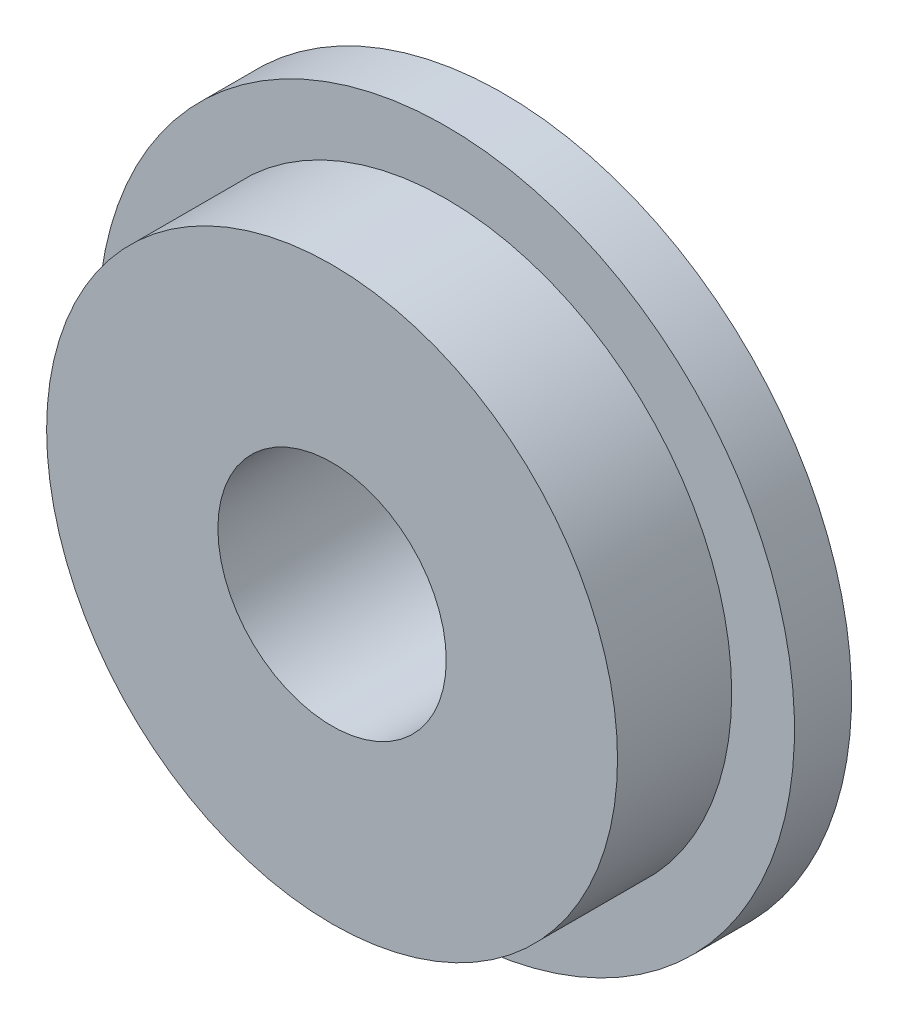
ISO-10303-21;
HEADER;
FILE_DESCRIPTION(('STEP AP214'),'2;1');
FILE_NAME('part.step','',(''),(''),'','','');
FILE_SCHEMA(('AUTOMOTIVE_DESIGN { 1 0 10303 214 1 1 1 1 }'));
ENDSEC;
DATA;
#1=APPLICATION_CONTEXT('core data for automotive mechanical design processes');
#2=APPLICATION_PROTOCOL_DEFINITION('international standard','automotive_design',2000,#1);
#3=PRODUCT_CONTEXT('',#1,'mechanical');
#4=PRODUCT('Part','Part','',(#3));
#5=PRODUCT_RELATED_PRODUCT_CATEGORY('part','',(#4));
#6=PRODUCT_DEFINITION_FORMATION('','',#4);
#7=PRODUCT_DEFINITION_CONTEXT('part definition',#1,'design');
#8=PRODUCT_DEFINITION('design','',#6,#7);
#9=PRODUCT_DEFINITION_SHAPE('','',#8);
#10=(LENGTH_UNIT() NAMED_UNIT(*) SI_UNIT(.MILLI.,.METRE.));
#11=(NAMED_UNIT(*) PLANE_ANGLE_UNIT() SI_UNIT($,.RADIAN.));
#12=(NAMED_UNIT(*) SI_UNIT($,.STERADIAN.) SOLID_ANGLE_UNIT());
#13=UNCERTAINTY_MEASURE_WITH_UNIT(LENGTH_MEASURE(1.E-05),#10,'distance_accuracy_value','');
#14=(GEOMETRIC_REPRESENTATION_CONTEXT(3) GLOBAL_UNCERTAINTY_ASSIGNED_CONTEXT((#13)) GLOBAL_UNIT_ASSIGNED_CONTEXT((#10,
#11,#12)) REPRESENTATION_CONTEXT('',''));
#15=CARTESIAN_POINT('',(0.,0.,0.));
#16=DIRECTION('',(0.,0.,1.));
#17=DIRECTION('',(1.,0.,0.));
#18=AXIS2_PLACEMENT_3D('',#15,#16,#17);
#19=CARTESIAN_POINT('',(0.,0.,1.5));
#20=DIRECTION('',(0.,0.,-1.));
#21=DIRECTION('',(-1.,0.,0.));
#22=AXIS2_PLACEMENT_3D('',#19,#20,#21);
#23=CYLINDRICAL_SURFACE('',#22,2.5);
#24=CARTESIAN_POINT('',(0.,0.,1.5));
#25=DIRECTION('',(0.,0.,1.));
#26=DIRECTION('',(1.,0.,0.));
#27=AXIS2_PLACEMENT_3D('',#24,#25,#26);
#28=CIRCLE('',#27,2.5);
#29=CARTESIAN_POINT('',(2.5,0.,1.5));
#30=VERTEX_POINT('',#29);
#31=EDGE_CURVE('E46',#30,#30,#28,.T.);
#32=ORIENTED_EDGE('',*,*,#31,.F.);
#33=EDGE_LOOP('',(#32));
#34=FACE_BOUND('',#33,.T.);
#35=CARTESIAN_POINT('',(0.,0.,0.5));
#36=DIRECTION('',(0.,0.,-1.));
#37=DIRECTION('',(-1.,0.,0.));
#38=AXIS2_PLACEMENT_3D('',#35,#36,#37);
#39=CIRCLE('',#38,2.5);
#40=CARTESIAN_POINT('',(-2.5,0.,0.5));
#41=VERTEX_POINT('',#40);
#42=EDGE_CURVE('E10',#41,#41,#39,.T.);
#43=ORIENTED_EDGE('',*,*,#42,.F.);
#44=EDGE_LOOP('',(#43));
#45=FACE_BOUND('',#44,.T.);
#46=ADVANCED_FACE('F39',(#34,#45),#23,.T.);
#47=CARTESIAN_POINT('',(0.,0.,1.5));
#48=DIRECTION('',(0.,0.,1.));
#49=DIRECTION('',(1.,0.,0.));
#50=AXIS2_PLACEMENT_3D('',#47,#48,#49);
#51=PLANE('',#50);
#52=CARTESIAN_POINT('',(0.,0.,1.5));
#53=DIRECTION('',(0.,0.,1.));
#54=DIRECTION('',(1.,0.,0.));
#55=AXIS2_PLACEMENT_3D('',#52,#53,#54);
#56=CIRCLE('',#55,1.);
#57=CARTESIAN_POINT('',(1.,0.,1.5));
#58=VERTEX_POINT('',#57);
#59=EDGE_CURVE('E61',#58,#58,#56,.T.);
#60=ORIENTED_EDGE('',*,*,#59,.F.);
#61=EDGE_LOOP('',(#60));
#62=FACE_BOUND('',#61,.T.);
#63=ORIENTED_EDGE('',*,*,#31,.T.);
#64=EDGE_LOOP('',(#63));
#65=FACE_BOUND('',#64,.T.);
#66=ADVANCED_FACE('F84',(#62,#65),#51,.T.);
#67=CARTESIAN_POINT('',(0.,0.,0.5));
#68=DIRECTION('',(0.,0.,-1.));
#69=DIRECTION('',(-1.,0.,0.));
#70=AXIS2_PLACEMENT_3D('',#67,#68,#69);
#71=CYLINDRICAL_SURFACE('',#70,3.05);
#72=CARTESIAN_POINT('',(0.,0.,0.5));
#73=DIRECTION('',(0.,0.,-1.));
#74=DIRECTION('',(-1.,0.,0.));
#75=AXIS2_PLACEMENT_3D('',#72,#73,#74);
#76=CIRCLE('',#75,3.05);
#77=CARTESIAN_POINT('',(-3.05,0.,0.5));
#78=VERTEX_POINT('',#77);
#79=EDGE_CURVE('E51',#78,#78,#76,.T.);
#80=ORIENTED_EDGE('',*,*,#79,.T.);
#81=EDGE_LOOP('',(#80));
#82=FACE_BOUND('',#81,.T.);
#83=CARTESIAN_POINT('',(0.,0.,0.));
#84=DIRECTION('',(0.,0.,-1.));
#85=DIRECTION('',(-1.,0.,0.));
#86=AXIS2_PLACEMENT_3D('',#83,#84,#85);
#87=CIRCLE('',#86,3.05);
#88=CARTESIAN_POINT('',(-3.05,0.,0.));
#89=VERTEX_POINT('',#88);
#90=EDGE_CURVE('E56',#89,#89,#87,.T.);
#91=ORIENTED_EDGE('',*,*,#90,.F.);
#92=EDGE_LOOP('',(#91));
#93=FACE_BOUND('',#92,.T.);
#94=ADVANCED_FACE('F89',(#82,#93),#71,.T.);
#95=CARTESIAN_POINT('',(0.,0.,0.5));
#96=DIRECTION('',(0.,0.,-1.));
#97=DIRECTION('',(-1.,0.,0.));
#98=AXIS2_PLACEMENT_3D('',#95,#96,#97);
#99=PLANE('',#98);
#100=ORIENTED_EDGE('',*,*,#42,.T.);
#101=EDGE_LOOP('',(#100));
#102=FACE_BOUND('',#101,.T.);
#103=ORIENTED_EDGE('',*,*,#79,.F.);
#104=EDGE_LOOP('',(#103));
#105=FACE_BOUND('',#104,.T.);
#106=ADVANCED_FACE('F81',(#102,#105),#99,.F.);
#107=CARTESIAN_POINT('',(0.,0.,0.));
#108=DIRECTION('',(0.,0.,1.));
#109=DIRECTION('',(1.,0.,0.));
#110=AXIS2_PLACEMENT_3D('',#107,#108,#109);
#111=PLANE('',#110);
#112=CARTESIAN_POINT('',(0.,0.,0.));
#113=DIRECTION('',(0.,0.,1.));
#114=DIRECTION('',(1.,0.,0.));
#115=AXIS2_PLACEMENT_3D('',#112,#113,#114);
#116=CIRCLE('',#115,1.);
#117=CARTESIAN_POINT('',(1.,0.,0.));
#118=VERTEX_POINT('',#117);
#119=EDGE_CURVE('E66',#118,#118,#116,.T.);
#120=ORIENTED_EDGE('',*,*,#119,.T.);
#121=EDGE_LOOP('',(#120));
#122=FACE_BOUND('',#121,.T.);
#123=ORIENTED_EDGE('',*,*,#90,.T.);
#124=EDGE_LOOP('',(#123));
#125=FACE_BOUND('',#124,.T.);
#126=ADVANCED_FACE('F71',(#122,#125),#111,.F.);
#127=CARTESIAN_POINT('',(0.,0.,0.));
#128=DIRECTION('',(0.,0.,1.));
#129=DIRECTION('',(1.,0.,0.));
#130=AXIS2_PLACEMENT_3D('',#127,#128,#129);
#131=CYLINDRICAL_SURFACE('',#130,1.);
#132=ORIENTED_EDGE('',*,*,#59,.T.);
#133=EDGE_LOOP('',(#132));
#134=FACE_BOUND('',#133,.T.);
#135=ORIENTED_EDGE('',*,*,#119,.F.);
#136=EDGE_LOOP('',(#135));
#137=FACE_BOUND('',#136,.T.);
#138=ADVANCED_FACE('F74',(#134,#137),#131,.F.);
#139=CLOSED_SHELL('',(#46,#66,#94,#106,#126,#138));
#140=MANIFOLD_SOLID_BREP('B2',#139);
#141=ADVANCED_BREP_SHAPE_REPRESENTATION('',(#18,#140),#14);
#142=SHAPE_DEFINITION_REPRESENTATION(#9,#141);
ENDSEC;
END-ISO-10303-21;
